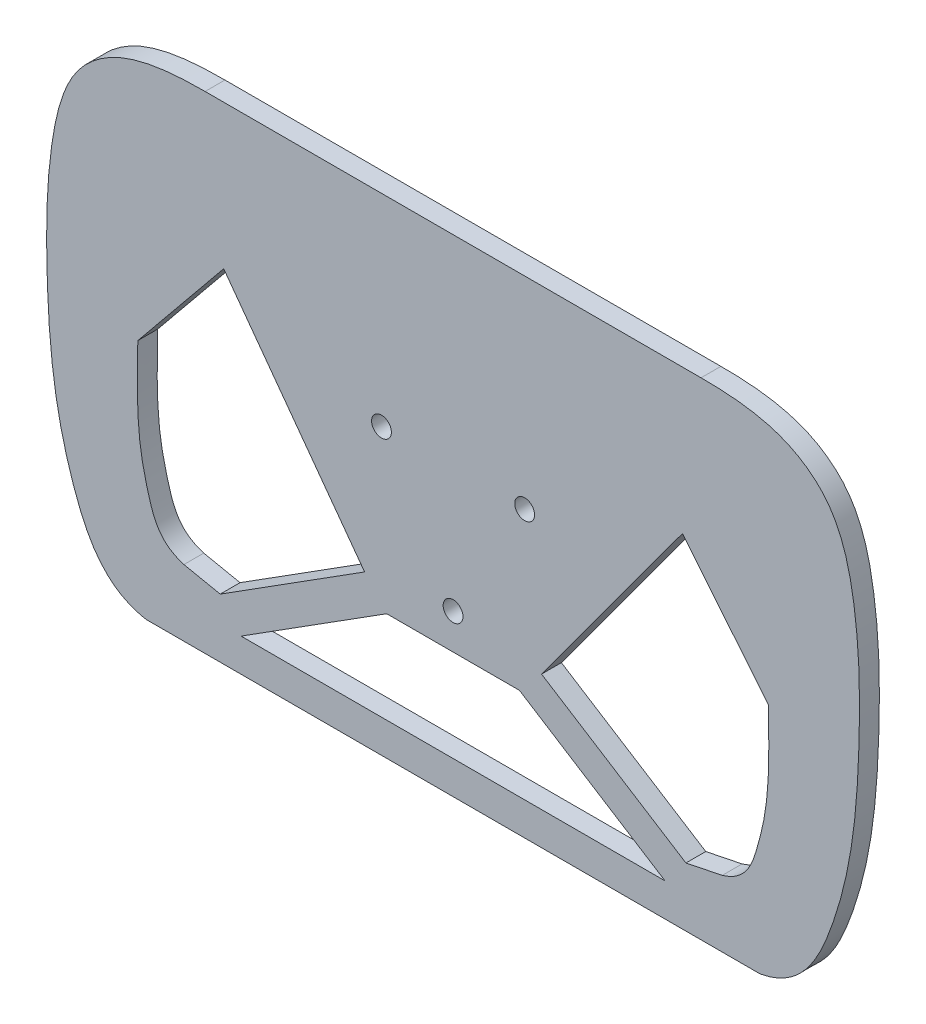
ISO-10303-21;
HEADER;
FILE_DESCRIPTION(('STEP AP214'),'2;1');
FILE_NAME('part.step','',(''),(''),'','','');
FILE_SCHEMA(('AUTOMOTIVE_DESIGN { 1 0 10303 214 1 1 1 1 }'));
ENDSEC;
DATA;
#1=APPLICATION_CONTEXT('core data for automotive mechanical design processes');
#2=APPLICATION_PROTOCOL_DEFINITION('international standard','automotive_design',2000,#1);
#3=PRODUCT_CONTEXT('',#1,'mechanical');
#4=PRODUCT('Part','Part','',(#3));
#5=PRODUCT_RELATED_PRODUCT_CATEGORY('part','',(#4));
#6=PRODUCT_DEFINITION_FORMATION('','',#4);
#7=PRODUCT_DEFINITION_CONTEXT('part definition',#1,'design');
#8=PRODUCT_DEFINITION('design','',#6,#7);
#9=PRODUCT_DEFINITION_SHAPE('','',#8);
#10=(LENGTH_UNIT() NAMED_UNIT(*) SI_UNIT(.MILLI.,.METRE.));
#11=(NAMED_UNIT(*) PLANE_ANGLE_UNIT() SI_UNIT($,.RADIAN.));
#12=(NAMED_UNIT(*) SI_UNIT($,.STERADIAN.) SOLID_ANGLE_UNIT());
#13=UNCERTAINTY_MEASURE_WITH_UNIT(LENGTH_MEASURE(1.E-05),#10,'distance_accuracy_value','');
#14=(GEOMETRIC_REPRESENTATION_CONTEXT(3) GLOBAL_UNCERTAINTY_ASSIGNED_CONTEXT((#13)) GLOBAL_UNIT_ASSIGNED_CONTEXT((#10,
#11,#12)) REPRESENTATION_CONTEXT('',''));
#15=CARTESIAN_POINT('',(0.,0.,0.));
#16=DIRECTION('',(0.,0.,1.));
#17=DIRECTION('',(1.,0.,0.));
#18=AXIS2_PLACEMENT_3D('',#15,#16,#17);
#19=CARTESIAN_POINT('',(122.926854575931,9.47046382232936,6.));
#20=DIRECTION('',(0.,0.,1.));
#21=DIRECTION('',(1.,0.,0.));
#22=AXIS2_PLACEMENT_3D('',#19,#20,#21);
#23=PLANE('',#22);
#24=CARTESIAN_POINT('',(21.650635094611,12.5,6.));
#25=DIRECTION('',(0.,0.,1.));
#26=DIRECTION('',(1.,0.,0.));
#27=AXIS2_PLACEMENT_3D('',#24,#25,#26);
#28=CIRCLE('',#27,3.00000000000001);
#29=CARTESIAN_POINT('',(24.650635094611,12.5,6.));
#30=VERTEX_POINT('',#29);
#31=EDGE_CURVE('E201',#30,#30,#28,.T.);
#32=ORIENTED_EDGE('',*,*,#31,.F.);
#33=EDGE_LOOP('',(#32));
#34=FACE_BOUND('',#33,.T.);
#35=DIRECTION('',(0.979722461987664,-0.200359420733916,0.));
#36=VECTOR('',#35,1.);
#37=CARTESIAN_POINT('',(-70.4230196252947,-55.7740436303517,6.));
#38=LINE('',#37,#36);
#39=CARTESIAN_POINT('',(-81.4077866513513,-53.5275895133638,6.));
#40=VERTEX_POINT('',#39);
#41=CARTESIAN_POINT('',(-70.4230196252947,-55.7740436303517,6.));
#42=VERTEX_POINT('',#41);
#43=EDGE_CURVE('E218',#40,#42,#38,.T.);
#44=ORIENTED_EDGE('',*,*,#43,.F.);
#45=CARTESIAN_POINT('',(-95.3562487472723,-1.84353900407075,6.));
#46=CARTESIAN_POINT('',(-95.6715273163188,-16.5555400141974,6.));
#47=CARTESIAN_POINT('',(-95.4951298956481,-27.3472539546752,6.));
#48=CARTESIAN_POINT('',(-91.456528801179,-43.4484898393174,6.));
#49=CARTESIAN_POINT('',(-88.6165775040413,-51.3763664990082,6.));
#50=CARTESIAN_POINT('',(-81.4077866513513,-53.5275895133638,6.));
#51=B_SPLINE_CURVE_WITH_KNOTS('',3,(#45,#46,#47,#48,#49,#50),.UNSPECIFIED.,.F.,.F.,(4,1,1,4),
(0.,0.501052943579188,0.678150100172681,1.),.UNSPECIFIED.);
#52=CARTESIAN_POINT('',(-95.3562487472723,-1.84353900407075,6.));
#53=VERTEX_POINT('',#52);
#54=EDGE_CURVE('E213',#53,#40,#51,.T.);
#55=ORIENTED_EDGE('',*,*,#54,.F.);
#56=DIRECTION('',(-0.632517478703731,-0.77454608586854,0.));
#57=VECTOR('',#56,1.);
#58=CARTESIAN_POINT('',(-69.3700327766014,29.9777505954936,6.));
#59=LINE('',#58,#57);
#60=CARTESIAN_POINT('',(-69.3700327766015,29.9777505954936,6.));
#61=VERTEX_POINT('',#60);
#62=EDGE_CURVE('E447',#61,#53,#59,.T.);
#63=ORIENTED_EDGE('',*,*,#62,.F.);
#64=DIRECTION('',(-0.591281996748165,0.806464878541839,0.));
#65=VECTOR('',#64,1.);
#66=CARTESIAN_POINT('',(-69.3700327766014,29.9777505954936,6.));
#67=LINE('',#66,#65);
#68=CARTESIAN_POINT('',(-26.7603793353234,-28.1386628522609,6.));
#69=VERTEX_POINT('',#68);
#70=EDGE_CURVE('E451',#69,#61,#67,.T.);
#71=ORIENTED_EDGE('',*,*,#70,.F.);
#72=DIRECTION('',(0.844973215996909,0.534808623946774,0.));
#73=VECTOR('',#72,1.);
#74=CARTESIAN_POINT('',(-26.7603793353234,-28.1386628522609,6.));
#75=LINE('',#74,#73);
#76=EDGE_CURVE('E450',#42,#69,#75,.T.);
#77=ORIENTED_EDGE('',*,*,#76,.F.);
#78=EDGE_LOOP('',(#44,#55,#63,#71,#77));
#79=FACE_BOUND('',#78,.T.);
#80=DIRECTION('',(-0.632517478703731,0.77454608586854,0.));
#81=VECTOR('',#80,1.);
#82=CARTESIAN_POINT('',(69.3700327766014,29.9777505954936,6.));
#83=LINE('',#82,#81);
#84=CARTESIAN_POINT('',(95.3562487472723,-1.84353900407075,6.));
#85=VERTEX_POINT('',#84);
#86=CARTESIAN_POINT('',(69.3700327766014,29.9777505954936,6.));
#87=VERTEX_POINT('',#86);
#88=EDGE_CURVE('E261',#85,#87,#83,.T.);
#89=ORIENTED_EDGE('',*,*,#88,.F.);
#90=CARTESIAN_POINT('',(81.4077866513513,-53.5275895133638,6.));
#91=CARTESIAN_POINT('',(88.6165775040413,-51.3763664990082,6.));
#92=CARTESIAN_POINT('',(91.456528801179,-43.4484898393174,6.));
#93=CARTESIAN_POINT('',(95.4951298956481,-27.3472539546752,6.));
#94=CARTESIAN_POINT('',(95.6715273163188,-16.5555400141974,6.));
#95=CARTESIAN_POINT('',(95.3562487472723,-1.84353900407075,6.));
#96=B_SPLINE_CURVE_WITH_KNOTS('',3,(#90,#91,#92,#93,#94,#95),.UNSPECIFIED.,.F.,.F.,(4,1,1,4),
(0.,0.321849899827319,0.498947056420812,1.),.UNSPECIFIED.);
#97=CARTESIAN_POINT('',(81.4077866513513,-53.5275895133638,6.));
#98=VERTEX_POINT('',#97);
#99=EDGE_CURVE('E255',#98,#85,#96,.T.);
#100=ORIENTED_EDGE('',*,*,#99,.F.);
#101=DIRECTION('',(0.979722461987664,0.200359420733916,0.));
#102=VECTOR('',#101,1.);
#103=CARTESIAN_POINT('',(70.4230196252947,-55.7740436303517,6.));
#104=LINE('',#103,#102);
#105=CARTESIAN_POINT('',(70.4230196252947,-55.7740436303517,6.));
#106=VERTEX_POINT('',#105);
#107=EDGE_CURVE('E274',#106,#98,#104,.T.);
#108=ORIENTED_EDGE('',*,*,#107,.F.);
#109=DIRECTION('',(0.844973215996909,-0.534808623946774,0.));
#110=VECTOR('',#109,1.);
#111=CARTESIAN_POINT('',(26.7603793353234,-28.1386628522609,6.));
#112=LINE('',#111,#110);
#113=CARTESIAN_POINT('',(26.7603793353234,-28.1386628522609,6.));
#114=VERTEX_POINT('',#113);
#115=EDGE_CURVE('E271',#114,#106,#112,.T.);
#116=ORIENTED_EDGE('',*,*,#115,.F.);
#117=DIRECTION('',(-0.591281996748165,-0.806464878541839,0.));
#118=VECTOR('',#117,1.);
#119=CARTESIAN_POINT('',(69.3700327766014,29.9777505954936,6.));
#120=LINE('',#119,#118);
#121=EDGE_CURVE('E269',#87,#114,#120,.T.);
#122=ORIENTED_EDGE('',*,*,#121,.F.);
#123=EDGE_LOOP('',(#89,#100,#108,#116,#122));
#124=FACE_BOUND('',#123,.T.);
#125=CARTESIAN_POINT('',(92.8418712487192,-73.620070940555,6.));
#126=CARTESIAN_POINT('',(105.213572209668,-71.4136232730018,6.));
#127=CARTESIAN_POINT('',(114.384033914454,-53.8766881853831,6.));
#128=CARTESIAN_POINT('',(121.422175920203,-25.8302321683413,6.));
#129=CARTESIAN_POINT('',(123.235734842072,4.23249483762891,6.));
#130=CARTESIAN_POINT('',(122.878964083038,33.9195099614847,6.));
#131=CARTESIAN_POINT('',(116.581294190115,59.7817578015624,6.));
#132=CARTESIAN_POINT('',(97.8546580759526,72.8495356195734,6.));
#133=CARTESIAN_POINT('',(82.6843703369774,73.592558306815,6.));
#134=CARTESIAN_POINT('',(75.,73.592558306815,6.));
#135=B_SPLINE_CURVE_WITH_KNOTS('',3,(#125,#126,#127,#128,#129,#130,#131,#132,#133,#134),
.UNSPECIFIED.,.F.,.F.,(4,1,1,1,1,1,1,4),(0.,0.171915862991571,0.299992691749042,
0.464505479266135,0.649132086789614,0.782672957897435,0.863001592636663,1.),.UNSPECIFIED.);
#136=CARTESIAN_POINT('',(92.8418712487192,-73.620070940555,6.));
#137=VERTEX_POINT('',#136);
#138=CARTESIAN_POINT('',(75.,73.592558306815,6.));
#139=VERTEX_POINT('',#138);
#140=EDGE_CURVE('E307',#137,#139,#135,.T.);
#141=ORIENTED_EDGE('',*,*,#140,.T.);
#142=DIRECTION('',(-1.,0.,0.));
#143=VECTOR('',#142,1.);
#144=CARTESIAN_POINT('',(-75.,73.592558306815,6.));
#145=LINE('',#144,#143);
#146=CARTESIAN_POINT('',(-75.,73.592558306815,6.));
#147=VERTEX_POINT('',#146);
#148=EDGE_CURVE('E313',#139,#147,#145,.T.);
#149=ORIENTED_EDGE('',*,*,#148,.T.);
#150=CARTESIAN_POINT('',(-75.,73.592558306815,6.));
#151=CARTESIAN_POINT('',(-82.6843703369774,73.592558306815,6.));
#152=CARTESIAN_POINT('',(-97.8546580759526,72.8495356195734,6.));
#153=CARTESIAN_POINT('',(-116.581294190115,59.7817578015624,6.));
#154=CARTESIAN_POINT('',(-122.878964083038,33.9195099614847,6.));
#155=CARTESIAN_POINT('',(-123.235734842072,4.23249483762891,6.));
#156=CARTESIAN_POINT('',(-121.422175920203,-25.8302321683413,6.));
#157=CARTESIAN_POINT('',(-114.384033914454,-53.8766881853831,6.));
#158=CARTESIAN_POINT('',(-105.213572209668,-71.4136232730018,6.));
#159=CARTESIAN_POINT('',(-92.8418712487192,-73.620070940555,6.));
#160=B_SPLINE_CURVE_WITH_KNOTS('',3,(#150,#151,#152,#153,#154,#155,#156,#157,#158,#159),
.UNSPECIFIED.,.F.,.F.,(4,1,1,1,1,1,1,4),(0.,0.136998407363337,0.217327042102565,
0.350867913210386,0.535494520733865,0.700007308250958,0.828084137008429,1.),.UNSPECIFIED.);
#161=CARTESIAN_POINT('',(-92.8418712487192,-73.620070940555,6.));
#162=VERTEX_POINT('',#161);
#163=EDGE_CURVE('E319',#147,#162,#160,.T.);
#164=ORIENTED_EDGE('',*,*,#163,.T.);
#165=DIRECTION('',(1.,0.,0.));
#166=VECTOR('',#165,1.);
#167=CARTESIAN_POINT('',(92.8418712487192,-73.620070940555,6.));
#168=LINE('',#167,#166);
#169=EDGE_CURVE('E324',#162,#137,#168,.T.);
#170=ORIENTED_EDGE('',*,*,#169,.T.);
#171=EDGE_LOOP('',(#141,#149,#164,#170));
#172=FACE_BOUND('',#171,.T.);
#173=CARTESIAN_POINT('',(-21.650635094611,12.5,6.));
#174=DIRECTION('',(0.,0.,1.));
#175=DIRECTION('',(1.,0.,0.));
#176=AXIS2_PLACEMENT_3D('',#173,#174,#175);
#177=CIRCLE('',#176,3.00000000000001);
#178=CARTESIAN_POINT('',(-18.650635094611,12.5,6.));
#179=VERTEX_POINT('',#178);
#180=EDGE_CURVE('E207',#179,#179,#177,.T.);
#181=ORIENTED_EDGE('',*,*,#180,.F.);
#182=EDGE_LOOP('',(#181));
#183=FACE_BOUND('',#182,.T.);
#184=CARTESIAN_POINT('',(0.,-25.,6.));
#185=DIRECTION('',(0.,0.,1.));
#186=DIRECTION('',(1.,0.,0.));
#187=AXIS2_PLACEMENT_3D('',#184,#185,#186);
#188=CIRCLE('',#187,3.);
#189=CARTESIAN_POINT('',(3.,-25.,6.));
#190=VERTEX_POINT('',#189);
#191=EDGE_CURVE('E195',#190,#190,#188,.T.);
#192=ORIENTED_EDGE('',*,*,#191,.F.);
#193=EDGE_LOOP('',(#192));
#194=FACE_BOUND('',#193,.T.);
#195=DIRECTION('',(-1.,0.,0.));
#196=VECTOR('',#195,1.);
#197=CARTESIAN_POINT('',(-20.070368486038,-35.7390511035356,6.));
#198=LINE('',#197,#196);
#199=CARTESIAN_POINT('',(20.070368486038,-35.7390511035356,6.));
#200=VERTEX_POINT('',#199);
#201=CARTESIAN_POINT('',(-20.070368486038,-35.7390511035356,6.));
#202=VERTEX_POINT('',#201);
#203=EDGE_CURVE('E167',#200,#202,#198,.T.);
#204=ORIENTED_EDGE('',*,*,#203,.F.);
#205=DIRECTION('',(-0.844973215996908,0.534808623946774,0.));
#206=VECTOR('',#205,1.);
#207=CARTESIAN_POINT('',(20.070368486038,-35.7390511035356,6.));
#208=LINE('',#207,#206);
#209=CARTESIAN_POINT('',(64.1211072776109,-63.620070940555,6.));
#210=VERTEX_POINT('',#209);
#211=EDGE_CURVE('E159',#210,#200,#208,.T.);
#212=ORIENTED_EDGE('',*,*,#211,.F.);
#213=DIRECTION('',(1.,0.,0.));
#214=VECTOR('',#213,1.);
#215=CARTESIAN_POINT('',(64.1211072776109,-63.620070940555,6.));
#216=LINE('',#215,#214);
#217=CARTESIAN_POINT('',(-64.1211072776109,-63.620070940555,6.));
#218=VERTEX_POINT('',#217);
#219=EDGE_CURVE('E181',#218,#210,#216,.T.);
#220=ORIENTED_EDGE('',*,*,#219,.F.);
#221=DIRECTION('',(-0.844973215996908,-0.534808623946774,0.));
#222=VECTOR('',#221,1.);
#223=CARTESIAN_POINT('',(-20.070368486038,-35.7390511035356,6.));
#224=LINE('',#223,#222);
#225=EDGE_CURVE('E179',#202,#218,#224,.T.);
#226=ORIENTED_EDGE('',*,*,#225,.F.);
#227=EDGE_LOOP('',(#204,#212,#220,#226));
#228=FACE_BOUND('',#227,.T.);
#229=ADVANCED_FACE('F33',(#34,#79,#124,#172,#183,#194,#228),#23,.T.);
#230=CARTESIAN_POINT('',(122.926854575931,9.47046382232936,0.));
#231=DIRECTION('',(0.,0.,1.));
#232=DIRECTION('',(1.,0.,0.));
#233=AXIS2_PLACEMENT_3D('',#230,#231,#232);
#234=PLANE('',#233);
#235=CARTESIAN_POINT('',(0.,-25.,0.));
#236=DIRECTION('',(0.,0.,1.));
#237=DIRECTION('',(1.,0.,0.));
#238=AXIS2_PLACEMENT_3D('',#235,#236,#237);
#239=CIRCLE('',#238,3.);
#240=CARTESIAN_POINT('',(3.,-25.,0.));
#241=VERTEX_POINT('',#240);
#242=EDGE_CURVE('E175',#241,#241,#239,.T.);
#243=ORIENTED_EDGE('',*,*,#242,.T.);
#244=EDGE_LOOP('',(#243));
#245=FACE_BOUND('',#244,.T.);
#246=CARTESIAN_POINT('',(21.650635094611,12.5,0.));
#247=DIRECTION('',(0.,0.,1.));
#248=DIRECTION('',(1.,0.,0.));
#249=AXIS2_PLACEMENT_3D('',#246,#247,#248);
#250=CIRCLE('',#249,3.00000000000001);
#251=CARTESIAN_POINT('',(24.650635094611,12.5,0.));
#252=VERTEX_POINT('',#251);
#253=EDGE_CURVE('E198',#252,#252,#250,.T.);
#254=ORIENTED_EDGE('',*,*,#253,.T.);
#255=EDGE_LOOP('',(#254));
#256=FACE_BOUND('',#255,.T.);
#257=CARTESIAN_POINT('',(-21.650635094611,12.5,0.));
#258=DIRECTION('',(0.,0.,1.));
#259=DIRECTION('',(1.,0.,0.));
#260=AXIS2_PLACEMENT_3D('',#257,#258,#259);
#261=CIRCLE('',#260,3.00000000000001);
#262=CARTESIAN_POINT('',(-18.650635094611,12.5,0.));
#263=VERTEX_POINT('',#262);
#264=EDGE_CURVE('E204',#263,#263,#261,.T.);
#265=ORIENTED_EDGE('',*,*,#264,.T.);
#266=EDGE_LOOP('',(#265));
#267=FACE_BOUND('',#266,.T.);
#268=CARTESIAN_POINT('',(-95.3562487472723,-1.84353900407075,0.));
#269=CARTESIAN_POINT('',(-95.6715273163188,-16.5555400141974,0.));
#270=CARTESIAN_POINT('',(-95.4951298956481,-27.3472539546752,0.));
#271=CARTESIAN_POINT('',(-91.456528801179,-43.4484898393174,0.));
#272=CARTESIAN_POINT('',(-88.6165775040413,-51.3763664990082,0.));
#273=CARTESIAN_POINT('',(-81.4077866513513,-53.5275895133638,0.));
#274=B_SPLINE_CURVE_WITH_KNOTS('',3,(#268,#269,#270,#271,#272,#273),.UNSPECIFIED.,.F.,.F.,(4,1,
1,4),(0.,0.501052943579188,0.678150100172681,1.),.UNSPECIFIED.);
#275=CARTESIAN_POINT('',(-95.3562487472724,-1.84353900407075,0.));
#276=VERTEX_POINT('',#275);
#277=CARTESIAN_POINT('',(-81.4077866513513,-53.5275895133638,0.));
#278=VERTEX_POINT('',#277);
#279=EDGE_CURVE('E210',#276,#278,#274,.T.);
#280=ORIENTED_EDGE('',*,*,#279,.T.);
#281=DIRECTION('',(0.979722461987664,-0.200359420733916,0.));
#282=VECTOR('',#281,1.);
#283=CARTESIAN_POINT('',(-70.4230196252947,-55.7740436303517,0.));
#284=LINE('',#283,#282);
#285=CARTESIAN_POINT('',(-70.4230196252947,-55.7740436303517,0.));
#286=VERTEX_POINT('',#285);
#287=EDGE_CURVE('E431',#278,#286,#284,.T.);
#288=ORIENTED_EDGE('',*,*,#287,.T.);
#289=DIRECTION('',(0.844973215996909,0.534808623946774,0.));
#290=VECTOR('',#289,1.);
#291=CARTESIAN_POINT('',(-26.7603793353234,-28.1386628522609,0.));
#292=LINE('',#291,#290);
#293=CARTESIAN_POINT('',(-26.7603793353234,-28.1386628522609,0.));
#294=VERTEX_POINT('',#293);
#295=EDGE_CURVE('E424',#286,#294,#292,.T.);
#296=ORIENTED_EDGE('',*,*,#295,.T.);
#297=DIRECTION('',(-0.591281996748165,0.806464878541839,0.));
#298=VECTOR('',#297,1.);
#299=CARTESIAN_POINT('',(-69.3700327766014,29.9777505954936,0.));
#300=LINE('',#299,#298);
#301=CARTESIAN_POINT('',(-69.3700327766014,29.9777505954936,0.));
#302=VERTEX_POINT('',#301);
#303=EDGE_CURVE('E430',#294,#302,#300,.T.);
#304=ORIENTED_EDGE('',*,*,#303,.T.);
#305=DIRECTION('',(-0.632517478703731,-0.77454608586854,0.));
#306=VECTOR('',#305,1.);
#307=CARTESIAN_POINT('',(-69.3700327766014,29.9777505954936,0.));
#308=LINE('',#307,#306);
#309=EDGE_CURVE('E219',#302,#276,#308,.T.);
#310=ORIENTED_EDGE('',*,*,#309,.T.);
#311=EDGE_LOOP('',(#280,#288,#296,#304,#310));
#312=FACE_BOUND('',#311,.T.);
#313=CARTESIAN_POINT('',(92.8418712487192,-73.620070940555,0.));
#314=CARTESIAN_POINT('',(105.213572209668,-71.4136232730018,0.));
#315=CARTESIAN_POINT('',(114.384033914454,-53.8766881853831,0.));
#316=CARTESIAN_POINT('',(121.422175920203,-25.8302321683413,0.));
#317=CARTESIAN_POINT('',(123.235734842072,4.23249483762891,0.));
#318=CARTESIAN_POINT('',(122.878964083038,33.9195099614847,0.));
#319=CARTESIAN_POINT('',(116.581294190115,59.7817578015624,0.));
#320=CARTESIAN_POINT('',(97.8546580759526,72.8495356195734,0.));
#321=CARTESIAN_POINT('',(82.6843703369774,73.592558306815,0.));
#322=CARTESIAN_POINT('',(75.,73.592558306815,0.));
#323=B_SPLINE_CURVE_WITH_KNOTS('',3,(#313,#314,#315,#316,#317,#318,#319,#320,#321,#322),
.UNSPECIFIED.,.F.,.F.,(4,1,1,1,1,1,1,4),(0.,0.171915862991571,0.299992691749042,
0.464505479266135,0.649132086789614,0.782672957897435,0.863001592636663,1.),.UNSPECIFIED.);
#324=CARTESIAN_POINT('',(92.8418712487192,-73.620070940555,0.));
#325=VERTEX_POINT('',#324);
#326=CARTESIAN_POINT('',(75.,73.592558306815,0.));
#327=VERTEX_POINT('',#326);
#328=EDGE_CURVE('E306',#325,#327,#323,.T.);
#329=ORIENTED_EDGE('',*,*,#328,.F.);
#330=DIRECTION('',(1.,0.,0.));
#331=VECTOR('',#330,1.);
#332=CARTESIAN_POINT('',(92.8418712487192,-73.620070940555,0.));
#333=LINE('',#332,#331);
#334=CARTESIAN_POINT('',(-92.8418712487192,-73.620070940555,0.));
#335=VERTEX_POINT('',#334);
#336=EDGE_CURVE('E314',#335,#325,#333,.T.);
#337=ORIENTED_EDGE('',*,*,#336,.F.);
#338=CARTESIAN_POINT('',(-75.,73.592558306815,0.));
#339=CARTESIAN_POINT('',(-82.6843703369774,73.592558306815,0.));
#340=CARTESIAN_POINT('',(-97.8546580759526,72.8495356195734,0.));
#341=CARTESIAN_POINT('',(-116.581294190115,59.7817578015624,0.));
#342=CARTESIAN_POINT('',(-122.878964083038,33.9195099614847,0.));
#343=CARTESIAN_POINT('',(-123.235734842072,4.23249483762891,0.));
#344=CARTESIAN_POINT('',(-121.422175920203,-25.8302321683413,0.));
#345=CARTESIAN_POINT('',(-114.384033914454,-53.8766881853831,0.));
#346=CARTESIAN_POINT('',(-105.213572209668,-71.4136232730018,0.));
#347=CARTESIAN_POINT('',(-92.8418712487192,-73.620070940555,0.));
#348=B_SPLINE_CURVE_WITH_KNOTS('',3,(#338,#339,#340,#341,#342,#343,#344,#345,#346,#347),
.UNSPECIFIED.,.F.,.F.,(4,1,1,1,1,1,1,4),(0.,0.136998407363337,0.217327042102565,
0.350867913210386,0.535494520733865,0.700007308250958,0.828084137008429,1.),.UNSPECIFIED.);
#349=CARTESIAN_POINT('',(-75.,73.592558306815,0.));
#350=VERTEX_POINT('',#349);
#351=EDGE_CURVE('E600',#350,#335,#348,.T.);
#352=ORIENTED_EDGE('',*,*,#351,.F.);
#353=DIRECTION('',(-1.,0.,0.));
#354=VECTOR('',#353,1.);
#355=CARTESIAN_POINT('',(-75.,73.592558306815,0.));
#356=LINE('',#355,#354);
#357=EDGE_CURVE('E608',#327,#350,#356,.T.);
#358=ORIENTED_EDGE('',*,*,#357,.F.);
#359=EDGE_LOOP('',(#329,#337,#352,#358));
#360=FACE_BOUND('',#359,.T.);
#361=CARTESIAN_POINT('',(81.4077866513513,-53.5275895133638,0.));
#362=CARTESIAN_POINT('',(88.6165775040413,-51.3763664990082,0.));
#363=CARTESIAN_POINT('',(91.456528801179,-43.4484898393174,0.));
#364=CARTESIAN_POINT('',(95.4951298956481,-27.3472539546752,0.));
#365=CARTESIAN_POINT('',(95.6715273163188,-16.5555400141974,0.));
#366=CARTESIAN_POINT('',(95.3562487472723,-1.84353900407075,0.));
#367=B_SPLINE_CURVE_WITH_KNOTS('',3,(#361,#362,#363,#364,#365,#366),.UNSPECIFIED.,.F.,.F.,(4,1,
1,4),(0.,0.321849899827319,0.498947056420812,1.),.UNSPECIFIED.);
#368=CARTESIAN_POINT('',(81.4077866513513,-53.5275895133638,0.));
#369=VERTEX_POINT('',#368);
#370=CARTESIAN_POINT('',(95.3562487472723,-1.84353900407075,0.));
#371=VERTEX_POINT('',#370);
#372=EDGE_CURVE('E277',#369,#371,#367,.T.);
#373=ORIENTED_EDGE('',*,*,#372,.T.);
#374=DIRECTION('',(-0.632517478703731,0.77454608586854,0.));
#375=VECTOR('',#374,1.);
#376=CARTESIAN_POINT('',(69.3700327766014,29.9777505954936,0.));
#377=LINE('',#376,#375);
#378=CARTESIAN_POINT('',(69.3700327766014,29.9777505954936,0.));
#379=VERTEX_POINT('',#378);
#380=EDGE_CURVE('E282',#371,#379,#377,.T.);
#381=ORIENTED_EDGE('',*,*,#380,.T.);
#382=DIRECTION('',(-0.591281996748165,-0.806464878541839,0.));
#383=VECTOR('',#382,1.);
#384=CARTESIAN_POINT('',(69.3700327766014,29.9777505954936,0.));
#385=LINE('',#384,#383);
#386=CARTESIAN_POINT('',(26.7603793353234,-28.1386628522609,0.));
#387=VERTEX_POINT('',#386);
#388=EDGE_CURVE('E288',#379,#387,#385,.T.);
#389=ORIENTED_EDGE('',*,*,#388,.T.);
#390=DIRECTION('',(0.844973215996909,-0.534808623946774,0.));
#391=VECTOR('',#390,1.);
#392=CARTESIAN_POINT('',(26.7603793353234,-28.1386628522609,0.));
#393=LINE('',#392,#391);
#394=CARTESIAN_POINT('',(70.4230196252947,-55.7740436303517,0.));
#395=VERTEX_POINT('',#394);
#396=EDGE_CURVE('E291',#387,#395,#393,.T.);
#397=ORIENTED_EDGE('',*,*,#396,.T.);
#398=DIRECTION('',(0.979722461987664,0.200359420733916,0.));
#399=VECTOR('',#398,1.);
#400=CARTESIAN_POINT('',(70.4230196252947,-55.7740436303517,0.));
#401=LINE('',#400,#399);
#402=EDGE_CURVE('E262',#395,#369,#401,.T.);
#403=ORIENTED_EDGE('',*,*,#402,.T.);
#404=EDGE_LOOP('',(#373,#381,#389,#397,#403));
#405=FACE_BOUND('',#404,.T.);
#406=DIRECTION('',(-0.844973215996908,0.534808623946774,0.));
#407=VECTOR('',#406,1.);
#408=CARTESIAN_POINT('',(20.070368486038,-35.7390511035356,0.));
#409=LINE('',#408,#407);
#410=CARTESIAN_POINT('',(64.1211072776109,-63.620070940555,0.));
#411=VERTEX_POINT('',#410);
#412=CARTESIAN_POINT('',(20.070368486038,-35.7390511035356,0.));
#413=VERTEX_POINT('',#412);
#414=EDGE_CURVE('E57',#411,#413,#409,.T.);
#415=ORIENTED_EDGE('',*,*,#414,.T.);
#416=DIRECTION('',(-1.,0.,0.));
#417=VECTOR('',#416,1.);
#418=CARTESIAN_POINT('',(-20.070368486038,-35.7390511035356,0.));
#419=LINE('',#418,#417);
#420=CARTESIAN_POINT('',(-20.070368486038,-35.7390511035356,0.));
#421=VERTEX_POINT('',#420);
#422=EDGE_CURVE('E174',#413,#421,#419,.T.);
#423=ORIENTED_EDGE('',*,*,#422,.T.);
#424=DIRECTION('',(-0.844973215996908,-0.534808623946774,0.));
#425=VECTOR('',#424,1.);
#426=CARTESIAN_POINT('',(-20.070368486038,-35.7390511035356,0.));
#427=LINE('',#426,#425);
#428=CARTESIAN_POINT('',(-64.1211072776109,-63.620070940555,0.));
#429=VERTEX_POINT('',#428);
#430=EDGE_CURVE('E187',#421,#429,#427,.T.);
#431=ORIENTED_EDGE('',*,*,#430,.T.);
#432=DIRECTION('',(1.,0.,0.));
#433=VECTOR('',#432,1.);
#434=CARTESIAN_POINT('',(64.1211072776109,-63.620070940555,0.));
#435=LINE('',#434,#433);
#436=EDGE_CURVE('E168',#429,#411,#435,.T.);
#437=ORIENTED_EDGE('',*,*,#436,.T.);
#438=EDGE_LOOP('',(#415,#423,#431,#437));
#439=FACE_BOUND('',#438,.T.);
#440=ADVANCED_FACE('F340',(#245,#256,#267,#312,#360,#405,#439),#234,.F.);
#441=DIRECTION('',(0.,0.,-1.));
#442=VECTOR('',#441,1.);
#443=SURFACE_OF_LINEAR_EXTRUSION('',#135,#442);
#444=ORIENTED_EDGE('',*,*,#328,.T.);
#445=DIRECTION('',(0.,0.,-1.));
#446=VECTOR('',#445,1.);
#447=CARTESIAN_POINT('',(75.,73.592558306815,6.));
#448=LINE('',#447,#446);
#449=EDGE_CURVE('E11',#139,#327,#448,.T.);
#450=ORIENTED_EDGE('',*,*,#449,.F.);
#451=ORIENTED_EDGE('',*,*,#140,.F.);
#452=DIRECTION('',(0.,0.,-1.));
#453=VECTOR('',#452,1.);
#454=CARTESIAN_POINT('',(92.8418712487192,-73.620070940555,6.));
#455=LINE('',#454,#453);
#456=EDGE_CURVE('E596',#137,#325,#455,.T.);
#457=ORIENTED_EDGE('',*,*,#456,.T.);
#458=EDGE_LOOP('',(#444,#450,#451,#457));
#459=FACE_BOUND('',#458,.T.);
#460=ADVANCED_FACE('F35',(#459),#443,.F.);
#461=CARTESIAN_POINT('',(-75.,73.592558306815,6.));
#462=DIRECTION('',(0.,-1.,0.));
#463=DIRECTION('',(0.,0.,-1.));
#464=AXIS2_PLACEMENT_3D('',#461,#462,#463);
#465=PLANE('',#464);
#466=ORIENTED_EDGE('',*,*,#357,.T.);
#467=DIRECTION('',(0.,0.,-1.));
#468=VECTOR('',#467,1.);
#469=CARTESIAN_POINT('',(-75.,73.592558306815,6.));
#470=LINE('',#469,#468);
#471=EDGE_CURVE('E42',#147,#350,#470,.T.);
#472=ORIENTED_EDGE('',*,*,#471,.F.);
#473=ORIENTED_EDGE('',*,*,#148,.F.);
#474=ORIENTED_EDGE('',*,*,#449,.T.);
#475=EDGE_LOOP('',(#466,#472,#473,#474));
#476=FACE_BOUND('',#475,.T.);
#477=ADVANCED_FACE('F333',(#476),#465,.F.);
#478=DIRECTION('',(0.,0.,-1.));
#479=VECTOR('',#478,1.);
#480=SURFACE_OF_LINEAR_EXTRUSION('',#160,#479);
#481=ORIENTED_EDGE('',*,*,#351,.T.);
#482=DIRECTION('',(0.,0.,-1.));
#483=VECTOR('',#482,1.);
#484=CARTESIAN_POINT('',(-92.8418712487192,-73.620070940555,6.));
#485=LINE('',#484,#483);
#486=EDGE_CURVE('E598',#162,#335,#485,.T.);
#487=ORIENTED_EDGE('',*,*,#486,.F.);
#488=ORIENTED_EDGE('',*,*,#163,.F.);
#489=ORIENTED_EDGE('',*,*,#471,.T.);
#490=EDGE_LOOP('',(#481,#487,#488,#489));
#491=FACE_BOUND('',#490,.T.);
#492=ADVANCED_FACE('F330',(#491),#480,.F.);
#493=CARTESIAN_POINT('',(92.8418712487192,-73.620070940555,6.));
#494=DIRECTION('',(0.,1.,0.));
#495=DIRECTION('',(0.,0.,1.));
#496=AXIS2_PLACEMENT_3D('',#493,#494,#495);
#497=PLANE('',#496);
#498=ORIENTED_EDGE('',*,*,#336,.T.);
#499=ORIENTED_EDGE('',*,*,#456,.F.);
#500=ORIENTED_EDGE('',*,*,#169,.F.);
#501=ORIENTED_EDGE('',*,*,#486,.T.);
#502=EDGE_LOOP('',(#498,#499,#500,#501));
#503=FACE_BOUND('',#502,.T.);
#504=ADVANCED_FACE('F252',(#503),#497,.F.);
#505=DIRECTION('',(0.,0.,-1.));
#506=VECTOR('',#505,1.);
#507=SURFACE_OF_LINEAR_EXTRUSION('',#96,#506);
#508=ORIENTED_EDGE('',*,*,#372,.F.);
#509=DIRECTION('',(0.,0.,-1.));
#510=VECTOR('',#509,1.);
#511=CARTESIAN_POINT('',(81.4077866513513,-53.5275895133638,6.));
#512=LINE('',#511,#510);
#513=EDGE_CURVE('E276',#98,#369,#512,.T.);
#514=ORIENTED_EDGE('',*,*,#513,.F.);
#515=ORIENTED_EDGE('',*,*,#99,.T.);
#516=DIRECTION('',(0.,0.,-1.));
#517=VECTOR('',#516,1.);
#518=CARTESIAN_POINT('',(95.3562487472723,-1.84353900407075,6.));
#519=LINE('',#518,#517);
#520=EDGE_CURVE('E304',#85,#371,#519,.T.);
#521=ORIENTED_EDGE('',*,*,#520,.T.);
#522=EDGE_LOOP('',(#508,#514,#515,#521));
#523=FACE_BOUND('',#522,.T.);
#524=ADVANCED_FACE('F247',(#523),#507,.T.);
#525=CARTESIAN_POINT('',(69.3700327766014,29.9777505954936,6.));
#526=DIRECTION('',(-0.77454608586854,-0.632517478703731,0.));
#527=DIRECTION('',(0.632517478703731,-0.77454608586854,0.));
#528=AXIS2_PLACEMENT_3D('',#525,#526,#527);
#529=PLANE('',#528);
#530=ORIENTED_EDGE('',*,*,#380,.F.);
#531=ORIENTED_EDGE('',*,*,#520,.F.);
#532=ORIENTED_EDGE('',*,*,#88,.T.);
#533=DIRECTION('',(0.,0.,-1.));
#534=VECTOR('',#533,1.);
#535=CARTESIAN_POINT('',(69.3700327766014,29.9777505954936,6.));
#536=LINE('',#535,#534);
#537=EDGE_CURVE('E302',#87,#379,#536,.T.);
#538=ORIENTED_EDGE('',*,*,#537,.T.);
#539=EDGE_LOOP('',(#530,#531,#532,#538));
#540=FACE_BOUND('',#539,.T.);
#541=ADVANCED_FACE('F243',(#540),#529,.T.);
#542=CARTESIAN_POINT('',(69.3700327766014,29.9777505954936,6.));
#543=DIRECTION('',(0.806464878541839,-0.591281996748165,0.));
#544=DIRECTION('',(0.591281996748165,0.806464878541839,0.));
#545=AXIS2_PLACEMENT_3D('',#542,#543,#544);
#546=PLANE('',#545);
#547=ORIENTED_EDGE('',*,*,#388,.F.);
#548=ORIENTED_EDGE('',*,*,#537,.F.);
#549=ORIENTED_EDGE('',*,*,#121,.T.);
#550=DIRECTION('',(0.,0.,-1.));
#551=VECTOR('',#550,1.);
#552=CARTESIAN_POINT('',(26.7603793353234,-28.1386628522609,6.));
#553=LINE('',#552,#551);
#554=EDGE_CURVE('E300',#114,#387,#553,.T.);
#555=ORIENTED_EDGE('',*,*,#554,.T.);
#556=EDGE_LOOP('',(#547,#548,#549,#555));
#557=FACE_BOUND('',#556,.T.);
#558=ADVANCED_FACE('F239',(#557),#546,.T.);
#559=CARTESIAN_POINT('',(26.7603793353234,-28.1386628522609,6.));
#560=DIRECTION('',(0.534808623946774,0.844973215996908,0.));
#561=DIRECTION('',(-0.844973215996909,0.534808623946774,0.));
#562=AXIS2_PLACEMENT_3D('',#559,#560,#561);
#563=PLANE('',#562);
#564=ORIENTED_EDGE('',*,*,#396,.F.);
#565=ORIENTED_EDGE('',*,*,#554,.F.);
#566=ORIENTED_EDGE('',*,*,#115,.T.);
#567=DIRECTION('',(0.,0.,-1.));
#568=VECTOR('',#567,1.);
#569=CARTESIAN_POINT('',(70.4230196252947,-55.7740436303517,6.));
#570=LINE('',#569,#568);
#571=EDGE_CURVE('E298',#106,#395,#570,.T.);
#572=ORIENTED_EDGE('',*,*,#571,.T.);
#573=EDGE_LOOP('',(#564,#565,#566,#572));
#574=FACE_BOUND('',#573,.T.);
#575=ADVANCED_FACE('F235',(#574),#563,.T.);
#576=CARTESIAN_POINT('',(70.4230196252947,-55.7740436303517,6.));
#577=DIRECTION('',(-0.200359420733916,0.979722461987664,0.));
#578=DIRECTION('',(-0.979722461987664,-0.200359420733916,0.));
#579=AXIS2_PLACEMENT_3D('',#576,#577,#578);
#580=PLANE('',#579);
#581=ORIENTED_EDGE('',*,*,#402,.F.);
#582=ORIENTED_EDGE('',*,*,#571,.F.);
#583=ORIENTED_EDGE('',*,*,#107,.T.);
#584=ORIENTED_EDGE('',*,*,#513,.T.);
#585=EDGE_LOOP('',(#581,#582,#583,#584));
#586=FACE_BOUND('',#585,.T.);
#587=ADVANCED_FACE('F230',(#586),#580,.T.);
#588=DIRECTION('',(0.,0.,-1.));
#589=VECTOR('',#588,1.);
#590=SURFACE_OF_LINEAR_EXTRUSION('',#51,#589);
#591=ORIENTED_EDGE('',*,*,#279,.F.);
#592=DIRECTION('',(0.,0.,-1.));
#593=VECTOR('',#592,1.);
#594=CARTESIAN_POINT('',(-95.3562487472723,-1.84353900407075,6.));
#595=LINE('',#594,#593);
#596=EDGE_CURVE('E443',#53,#276,#595,.T.);
#597=ORIENTED_EDGE('',*,*,#596,.F.);
#598=ORIENTED_EDGE('',*,*,#54,.T.);
#599=DIRECTION('',(0.,0.,-1.));
#600=VECTOR('',#599,1.);
#601=CARTESIAN_POINT('',(-81.4077866513513,-53.5275895133638,6.));
#602=LINE('',#601,#600);
#603=EDGE_CURVE('E263',#40,#278,#602,.T.);
#604=ORIENTED_EDGE('',*,*,#603,.T.);
#605=EDGE_LOOP('',(#591,#597,#598,#604));
#606=FACE_BOUND('',#605,.T.);
#607=ADVANCED_FACE('F225',(#606),#590,.T.);
#608=CARTESIAN_POINT('',(-70.4230196252947,-55.7740436303517,6.));
#609=DIRECTION('',(0.200359420733916,0.979722461987664,0.));
#610=DIRECTION('',(-0.979722461987664,0.200359420733916,0.));
#611=AXIS2_PLACEMENT_3D('',#608,#609,#610);
#612=PLANE('',#611);
#613=ORIENTED_EDGE('',*,*,#287,.F.);
#614=ORIENTED_EDGE('',*,*,#603,.F.);
#615=ORIENTED_EDGE('',*,*,#43,.T.);
#616=DIRECTION('',(0.,0.,-1.));
#617=VECTOR('',#616,1.);
#618=CARTESIAN_POINT('',(-70.4230196252947,-55.7740436303517,6.));
#619=LINE('',#618,#617);
#620=EDGE_CURVE('E425',#42,#286,#619,.T.);
#621=ORIENTED_EDGE('',*,*,#620,.T.);
#622=EDGE_LOOP('',(#613,#614,#615,#621));
#623=FACE_BOUND('',#622,.T.);
#624=ADVANCED_FACE('F229',(#623),#612,.T.);
#625=CARTESIAN_POINT('',(-26.7603793353234,-28.1386628522609,6.));
#626=DIRECTION('',(-0.534808623946774,0.844973215996908,0.));
#627=DIRECTION('',(-0.844973215996909,-0.534808623946774,0.));
#628=AXIS2_PLACEMENT_3D('',#625,#626,#627);
#629=PLANE('',#628);
#630=ORIENTED_EDGE('',*,*,#295,.F.);
#631=ORIENTED_EDGE('',*,*,#620,.F.);
#632=ORIENTED_EDGE('',*,*,#76,.T.);
#633=DIRECTION('',(0.,0.,-1.));
#634=VECTOR('',#633,1.);
#635=CARTESIAN_POINT('',(-26.7603793353234,-28.1386628522609,6.));
#636=LINE('',#635,#634);
#637=EDGE_CURVE('E427',#69,#294,#636,.T.);
#638=ORIENTED_EDGE('',*,*,#637,.T.);
#639=EDGE_LOOP('',(#630,#631,#632,#638));
#640=FACE_BOUND('',#639,.T.);
#641=ADVANCED_FACE('F413',(#640),#629,.T.);
#642=CARTESIAN_POINT('',(-69.3700327766014,29.9777505954936,6.));
#643=DIRECTION('',(-0.806464878541839,-0.591281996748165,0.));
#644=DIRECTION('',(0.591281996748165,-0.806464878541839,0.));
#645=AXIS2_PLACEMENT_3D('',#642,#643,#644);
#646=PLANE('',#645);
#647=ORIENTED_EDGE('',*,*,#303,.F.);
#648=ORIENTED_EDGE('',*,*,#637,.F.);
#649=ORIENTED_EDGE('',*,*,#70,.T.);
#650=DIRECTION('',(0.,0.,-1.));
#651=VECTOR('',#650,1.);
#652=CARTESIAN_POINT('',(-69.3700327766014,29.9777505954936,6.));
#653=LINE('',#652,#651);
#654=EDGE_CURVE('E446',#61,#302,#653,.T.);
#655=ORIENTED_EDGE('',*,*,#654,.T.);
#656=EDGE_LOOP('',(#647,#648,#649,#655));
#657=FACE_BOUND('',#656,.T.);
#658=ADVANCED_FACE('F410',(#657),#646,.T.);
#659=CARTESIAN_POINT('',(-69.3700327766014,29.9777505954936,6.));
#660=DIRECTION('',(0.77454608586854,-0.632517478703731,0.));
#661=DIRECTION('',(0.632517478703731,0.77454608586854,0.));
#662=AXIS2_PLACEMENT_3D('',#659,#660,#661);
#663=PLANE('',#662);
#664=ORIENTED_EDGE('',*,*,#309,.F.);
#665=ORIENTED_EDGE('',*,*,#654,.F.);
#666=ORIENTED_EDGE('',*,*,#62,.T.);
#667=ORIENTED_EDGE('',*,*,#596,.T.);
#668=EDGE_LOOP('',(#664,#665,#666,#667));
#669=FACE_BOUND('',#668,.T.);
#670=ADVANCED_FACE('F406',(#669),#663,.T.);
#671=CARTESIAN_POINT('',(-21.650635094611,12.5,6.));
#672=DIRECTION('',(0.,0.,-1.));
#673=DIRECTION('',(-1.,0.,0.));
#674=AXIS2_PLACEMENT_3D('',#671,#672,#673);
#675=CYLINDRICAL_SURFACE('',#674,3.00000000000001);
#676=ORIENTED_EDGE('',*,*,#180,.T.);
#677=EDGE_LOOP('',(#676));
#678=FACE_BOUND('',#677,.T.);
#679=ORIENTED_EDGE('',*,*,#264,.F.);
#680=EDGE_LOOP('',(#679));
#681=FACE_BOUND('',#680,.T.);
#682=ADVANCED_FACE('F402',(#678,#681),#675,.F.);
#683=CARTESIAN_POINT('',(21.650635094611,12.5,6.));
#684=DIRECTION('',(0.,0.,-1.));
#685=DIRECTION('',(-1.,0.,0.));
#686=AXIS2_PLACEMENT_3D('',#683,#684,#685);
#687=CYLINDRICAL_SURFACE('',#686,3.00000000000001);
#688=ORIENTED_EDGE('',*,*,#31,.T.);
#689=EDGE_LOOP('',(#688));
#690=FACE_BOUND('',#689,.T.);
#691=ORIENTED_EDGE('',*,*,#253,.F.);
#692=EDGE_LOOP('',(#691));
#693=FACE_BOUND('',#692,.T.);
#694=ADVANCED_FACE('F368',(#690,#693),#687,.F.);
#695=CARTESIAN_POINT('',(0.,-25.,6.));
#696=DIRECTION('',(0.,0.,-1.));
#697=DIRECTION('',(-1.,0.,0.));
#698=AXIS2_PLACEMENT_3D('',#695,#696,#697);
#699=CYLINDRICAL_SURFACE('',#698,3.);
#700=ORIENTED_EDGE('',*,*,#191,.T.);
#701=EDGE_LOOP('',(#700));
#702=FACE_BOUND('',#701,.T.);
#703=ORIENTED_EDGE('',*,*,#242,.F.);
#704=EDGE_LOOP('',(#703));
#705=FACE_BOUND('',#704,.T.);
#706=ADVANCED_FACE('F365',(#702,#705),#699,.F.);
#707=CARTESIAN_POINT('',(20.070368486038,-35.7390511035356,6.));
#708=DIRECTION('',(-0.534808623946774,-0.844973215996908,0.));
#709=DIRECTION('',(0.844973215996908,-0.534808623946774,0.));
#710=AXIS2_PLACEMENT_3D('',#707,#708,#709);
#711=PLANE('',#710);
#712=ORIENTED_EDGE('',*,*,#414,.F.);
#713=DIRECTION('',(0.,0.,-1.));
#714=VECTOR('',#713,1.);
#715=CARTESIAN_POINT('',(64.1211072776109,-63.620070940555,6.));
#716=LINE('',#715,#714);
#717=EDGE_CURVE('E163',#210,#411,#716,.T.);
#718=ORIENTED_EDGE('',*,*,#717,.F.);
#719=ORIENTED_EDGE('',*,*,#211,.T.);
#720=DIRECTION('',(0.,0.,-1.));
#721=VECTOR('',#720,1.);
#722=CARTESIAN_POINT('',(20.070368486038,-35.7390511035356,6.));
#723=LINE('',#722,#721);
#724=EDGE_CURVE('E162',#200,#413,#723,.T.);
#725=ORIENTED_EDGE('',*,*,#724,.T.);
#726=EDGE_LOOP('',(#712,#718,#719,#725));
#727=FACE_BOUND('',#726,.T.);
#728=ADVANCED_FACE('F161',(#727),#711,.T.);
#729=CARTESIAN_POINT('',(-20.070368486038,-35.7390511035356,6.));
#730=DIRECTION('',(0.,-1.,0.));
#731=DIRECTION('',(0.,0.,-1.));
#732=AXIS2_PLACEMENT_3D('',#729,#730,#731);
#733=PLANE('',#732);
#734=ORIENTED_EDGE('',*,*,#422,.F.);
#735=ORIENTED_EDGE('',*,*,#724,.F.);
#736=ORIENTED_EDGE('',*,*,#203,.T.);
#737=DIRECTION('',(0.,0.,-1.));
#738=VECTOR('',#737,1.);
#739=CARTESIAN_POINT('',(-20.070368486038,-35.7390511035356,6.));
#740=LINE('',#739,#738);
#741=EDGE_CURVE('E176',#202,#421,#740,.T.);
#742=ORIENTED_EDGE('',*,*,#741,.T.);
#743=EDGE_LOOP('',(#734,#735,#736,#742));
#744=FACE_BOUND('',#743,.T.);
#745=ADVANCED_FACE('F171',(#744),#733,.T.);
#746=CARTESIAN_POINT('',(-20.070368486038,-35.7390511035356,6.));
#747=DIRECTION('',(0.534808623946774,-0.844973215996908,0.));
#748=DIRECTION('',(0.844973215996908,0.534808623946774,0.));
#749=AXIS2_PLACEMENT_3D('',#746,#747,#748);
#750=PLANE('',#749);
#751=ORIENTED_EDGE('',*,*,#430,.F.);
#752=ORIENTED_EDGE('',*,*,#741,.F.);
#753=ORIENTED_EDGE('',*,*,#225,.T.);
#754=DIRECTION('',(0.,0.,-1.));
#755=VECTOR('',#754,1.);
#756=CARTESIAN_POINT('',(-64.1211072776109,-63.620070940555,6.));
#757=LINE('',#756,#755);
#758=EDGE_CURVE('E49',#218,#429,#757,.T.);
#759=ORIENTED_EDGE('',*,*,#758,.T.);
#760=EDGE_LOOP('',(#751,#752,#753,#759));
#761=FACE_BOUND('',#760,.T.);
#762=ADVANCED_FACE('F388',(#761),#750,.T.);
#763=CARTESIAN_POINT('',(64.1211072776109,-63.620070940555,6.));
#764=DIRECTION('',(0.,1.,0.));
#765=DIRECTION('',(0.,0.,1.));
#766=AXIS2_PLACEMENT_3D('',#763,#764,#765);
#767=PLANE('',#766);
#768=ORIENTED_EDGE('',*,*,#436,.F.);
#769=ORIENTED_EDGE('',*,*,#758,.F.);
#770=ORIENTED_EDGE('',*,*,#219,.T.);
#771=ORIENTED_EDGE('',*,*,#717,.T.);
#772=EDGE_LOOP('',(#768,#769,#770,#771));
#773=FACE_BOUND('',#772,.T.);
#774=ADVANCED_FACE('F386',(#773),#767,.T.);
#775=CLOSED_SHELL('',(#229,#440,#460,#477,#492,#504,#524,#541,#558,#575,#587,#607,#624,#641,
#658,#670,#682,#694,#706,#728,#745,#762,#774));
#776=MANIFOLD_SOLID_BREP('B2',#775);
#777=ADVANCED_BREP_SHAPE_REPRESENTATION('',(#18,#776),#14);
#778=SHAPE_DEFINITION_REPRESENTATION(#9,#777);
ENDSEC;
END-ISO-10303-21;
